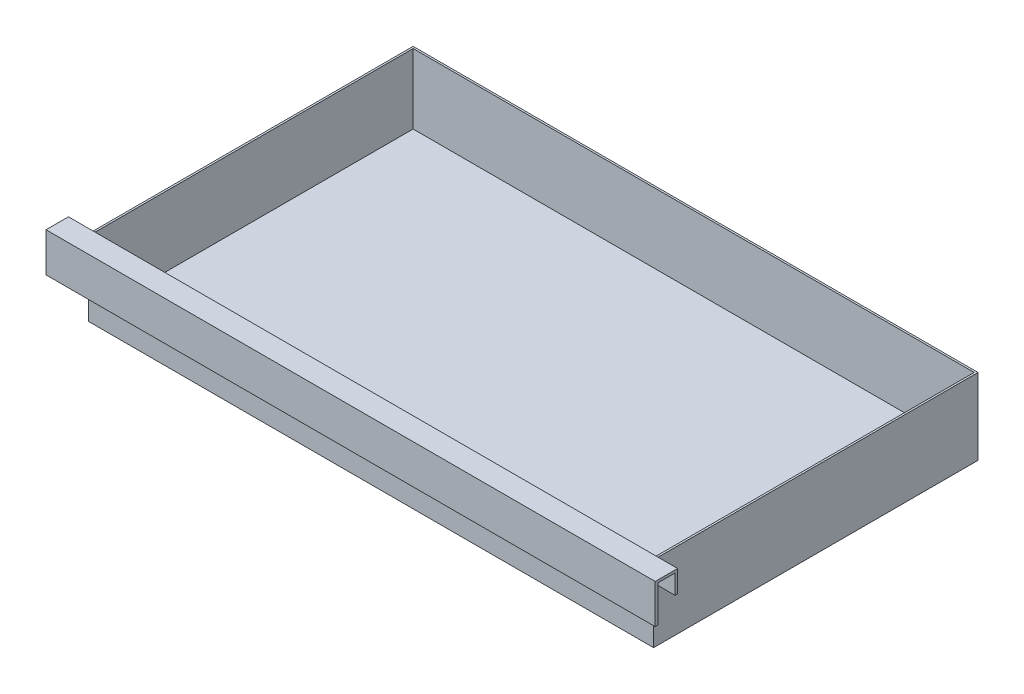
ISO-10303-21;
HEADER;
FILE_DESCRIPTION(('STEP AP214'),'2;1');
FILE_NAME('part.step','',(''),(''),'','','');
FILE_SCHEMA(('AUTOMOTIVE_DESIGN { 1 0 10303 214 1 1 1 1 }'));
ENDSEC;
DATA;
#1=APPLICATION_CONTEXT('core data for automotive mechanical design processes');
#2=APPLICATION_PROTOCOL_DEFINITION('international standard','automotive_design',2000,#1);
#3=PRODUCT_CONTEXT('',#1,'mechanical');
#4=PRODUCT('Part','Part','',(#3));
#5=PRODUCT_RELATED_PRODUCT_CATEGORY('part','',(#4));
#6=PRODUCT_DEFINITION_FORMATION('','',#4);
#7=PRODUCT_DEFINITION_CONTEXT('part definition',#1,'design');
#8=PRODUCT_DEFINITION('design','',#6,#7);
#9=PRODUCT_DEFINITION_SHAPE('','',#8);
#10=(LENGTH_UNIT() NAMED_UNIT(*) SI_UNIT(.MILLI.,.METRE.));
#11=(NAMED_UNIT(*) PLANE_ANGLE_UNIT() SI_UNIT($,.RADIAN.));
#12=(NAMED_UNIT(*) SI_UNIT($,.STERADIAN.) SOLID_ANGLE_UNIT());
#13=UNCERTAINTY_MEASURE_WITH_UNIT(LENGTH_MEASURE(1.E-05),#10,'distance_accuracy_value','');
#14=(GEOMETRIC_REPRESENTATION_CONTEXT(3) GLOBAL_UNCERTAINTY_ASSIGNED_CONTEXT((#13)) GLOBAL_UNIT_ASSIGNED_CONTEXT((#10,
#11,#12)) REPRESENTATION_CONTEXT('',''));
#15=CARTESIAN_POINT('',(0.,0.,0.));
#16=DIRECTION('',(0.,0.,1.));
#17=DIRECTION('',(1.,0.,0.));
#18=AXIS2_PLACEMENT_3D('',#15,#16,#17);
#19=CARTESIAN_POINT('',(111.8743,2.54,0.));
#20=DIRECTION('',(-1.,0.,0.));
#21=DIRECTION('',(0.,0.,1.));
#22=AXIS2_PLACEMENT_3D('',#19,#20,#21);
#23=PLANE('',#22);
#24=DIRECTION('',(0.,-1.,0.));
#25=VECTOR('',#24,1.);
#26=CARTESIAN_POINT('',(111.8743,2.54,0.));
#27=LINE('',#26,#25);
#28=CARTESIAN_POINT('',(111.8743,30.1625,0.));
#29=VERTEX_POINT('',#28);
#30=CARTESIAN_POINT('',(111.8743,22.4754146021905,0.));
#31=VERTEX_POINT('',#30);
#32=EDGE_CURVE('E57',#29,#31,#27,.T.);
#33=ORIENTED_EDGE('',*,*,#32,.T.);
#34=DIRECTION('',(0.,0.,1.));
#35=VECTOR('',#34,1.);
#36=CARTESIAN_POINT('',(111.8743,22.4754146021905,0.));
#37=LINE('',#36,#35);
#38=CARTESIAN_POINT('',(111.8743,22.4754146021905,0.7493));
#39=VERTEX_POINT('',#38);
#40=EDGE_CURVE('E176',#31,#39,#37,.T.);
#41=ORIENTED_EDGE('',*,*,#40,.T.);
#42=DIRECTION('',(0.,-1.,0.));
#43=VECTOR('',#42,1.);
#44=CARTESIAN_POINT('',(111.8743,2.54,0.7493));
#45=LINE('',#44,#43);
#46=CARTESIAN_POINT('',(111.8743,0.,0.7493));
#47=VERTEX_POINT('',#46);
#48=EDGE_CURVE('E306',#39,#47,#45,.T.);
#49=ORIENTED_EDGE('',*,*,#48,.T.);
#50=DIRECTION('',(0.,0.,-1.));
#51=VECTOR('',#50,1.);
#52=CARTESIAN_POINT('',(111.8743,0.,0.));
#53=LINE('',#52,#51);
#54=CARTESIAN_POINT('',(111.8743,0.,-127.7493));
#55=VERTEX_POINT('',#54);
#56=EDGE_CURVE('E295',#47,#55,#53,.T.);
#57=ORIENTED_EDGE('',*,*,#56,.T.);
#58=DIRECTION('',(0.,-1.,0.));
#59=VECTOR('',#58,1.);
#60=CARTESIAN_POINT('',(111.8743,2.54,-127.7493));
#61=LINE('',#60,#59);
#62=CARTESIAN_POINT('',(111.8743,30.1625,-127.7493));
#63=VERTEX_POINT('',#62);
#64=EDGE_CURVE('E11',#63,#55,#61,.T.);
#65=ORIENTED_EDGE('',*,*,#64,.F.);
#66=DIRECTION('',(0.,0.,-1.));
#67=VECTOR('',#66,1.);
#68=CARTESIAN_POINT('',(111.8743,30.1625,0.7493));
#69=LINE('',#68,#67);
#70=EDGE_CURVE('E282',#29,#63,#69,.T.);
#71=ORIENTED_EDGE('',*,*,#70,.F.);
#72=EDGE_LOOP('',(#33,#41,#49,#57,#65,#71));
#73=FACE_BOUND('',#72,.T.);
#74=ADVANCED_FACE('F43',(#73),#23,.F.);
#75=CARTESIAN_POINT('',(0.,2.54,-127.7493));
#76=DIRECTION('',(0.,0.,1.));
#77=DIRECTION('',(1.,0.,0.));
#78=AXIS2_PLACEMENT_3D('',#75,#76,#77);
#79=PLANE('',#78);
#80=DIRECTION('',(-1.,0.,0.));
#81=VECTOR('',#80,1.);
#82=CARTESIAN_POINT('',(0.,0.,-127.7493));
#83=LINE('',#82,#81);
#84=CARTESIAN_POINT('',(-111.8743,0.,-127.7493));
#85=VERTEX_POINT('',#84);
#86=EDGE_CURVE('E298',#55,#85,#83,.T.);
#87=ORIENTED_EDGE('',*,*,#86,.T.);
#88=DIRECTION('',(0.,-1.,0.));
#89=VECTOR('',#88,1.);
#90=CARTESIAN_POINT('',(-111.8743,2.54,-127.7493));
#91=LINE('',#90,#89);
#92=CARTESIAN_POINT('',(-111.8743,30.1625,-127.7493));
#93=VERTEX_POINT('',#92);
#94=EDGE_CURVE('E50',#93,#85,#91,.T.);
#95=ORIENTED_EDGE('',*,*,#94,.F.);
#96=DIRECTION('',(-1.,0.,0.));
#97=VECTOR('',#96,1.);
#98=CARTESIAN_POINT('',(111.8743,30.1625,-127.7493));
#99=LINE('',#98,#97);
#100=EDGE_CURVE('E277',#63,#93,#99,.T.);
#101=ORIENTED_EDGE('',*,*,#100,.F.);
#102=ORIENTED_EDGE('',*,*,#64,.T.);
#103=EDGE_LOOP('',(#87,#95,#101,#102));
#104=FACE_BOUND('',#103,.T.);
#105=ADVANCED_FACE('F360',(#104),#79,.F.);
#106=CARTESIAN_POINT('',(-111.8743,2.54,0.));
#107=DIRECTION('',(1.,0.,0.));
#108=DIRECTION('',(0.,0.,-1.));
#109=AXIS2_PLACEMENT_3D('',#106,#107,#108);
#110=PLANE('',#109);
#111=DIRECTION('',(0.,-1.,0.));
#112=VECTOR('',#111,1.);
#113=CARTESIAN_POINT('',(-111.8743,2.54,0.7493));
#114=LINE('',#113,#112);
#115=CARTESIAN_POINT('',(-111.8743,22.4754146021905,0.7493));
#116=VERTEX_POINT('',#115);
#117=CARTESIAN_POINT('',(-111.8743,0.,0.7493));
#118=VERTEX_POINT('',#117);
#119=EDGE_CURVE('E308',#116,#118,#114,.T.);
#120=ORIENTED_EDGE('',*,*,#119,.F.);
#121=DIRECTION('',(0.,0.,-1.));
#122=VECTOR('',#121,1.);
#123=CARTESIAN_POINT('',(-111.8743,22.4754146021905,0.));
#124=LINE('',#123,#122);
#125=CARTESIAN_POINT('',(-111.8743,22.4754146021905,0.));
#126=VERTEX_POINT('',#125);
#127=EDGE_CURVE('E65',#116,#126,#124,.T.);
#128=ORIENTED_EDGE('',*,*,#127,.T.);
#129=DIRECTION('',(0.,1.,0.));
#130=VECTOR('',#129,1.);
#131=CARTESIAN_POINT('',(-111.8743,2.54,0.));
#132=LINE('',#131,#130);
#133=CARTESIAN_POINT('',(-111.8743,30.1625,0.));
#134=VERTEX_POINT('',#133);
#135=EDGE_CURVE('E252',#126,#134,#132,.T.);
#136=ORIENTED_EDGE('',*,*,#135,.T.);
#137=DIRECTION('',(0.,0.,1.));
#138=VECTOR('',#137,1.);
#139=CARTESIAN_POINT('',(-111.8743,30.1625,-127.7493));
#140=LINE('',#139,#138);
#141=EDGE_CURVE('E280',#93,#134,#140,.T.);
#142=ORIENTED_EDGE('',*,*,#141,.F.);
#143=ORIENTED_EDGE('',*,*,#94,.T.);
#144=DIRECTION('',(0.,0.,1.));
#145=VECTOR('',#144,1.);
#146=CARTESIAN_POINT('',(-111.8743,0.,0.));
#147=LINE('',#146,#145);
#148=EDGE_CURVE('E300',#85,#118,#147,.T.);
#149=ORIENTED_EDGE('',*,*,#148,.T.);
#150=EDGE_LOOP('',(#120,#128,#136,#142,#143,#149));
#151=FACE_BOUND('',#150,.T.);
#152=ADVANCED_FACE('F312',(#151),#110,.F.);
#153=CARTESIAN_POINT('',(0.,2.54,0.7493));
#154=DIRECTION('',(0.,0.,-1.));
#155=DIRECTION('',(-1.,0.,0.));
#156=AXIS2_PLACEMENT_3D('',#153,#154,#155);
#157=PLANE('',#156);
#158=ORIENTED_EDGE('',*,*,#48,.F.);
#159=DIRECTION('',(-1.,0.,0.));
#160=VECTOR('',#159,1.);
#161=CARTESIAN_POINT('',(0.,22.4754146021905,0.7493));
#162=LINE('',#161,#160);
#163=EDGE_CURVE('E255',#39,#116,#162,.T.);
#164=ORIENTED_EDGE('',*,*,#163,.T.);
#165=ORIENTED_EDGE('',*,*,#119,.T.);
#166=DIRECTION('',(1.,0.,0.));
#167=VECTOR('',#166,1.);
#168=CARTESIAN_POINT('',(0.,0.,0.7493));
#169=LINE('',#168,#167);
#170=EDGE_CURVE('E303',#118,#47,#169,.T.);
#171=ORIENTED_EDGE('',*,*,#170,.T.);
#172=EDGE_LOOP('',(#158,#164,#165,#171));
#173=FACE_BOUND('',#172,.T.);
#174=ADVANCED_FACE('F321',(#173),#157,.F.);
#175=CARTESIAN_POINT('',(0.,0.,0.));
#176=DIRECTION('',(0.,1.,0.));
#177=DIRECTION('',(0.,0.,1.));
#178=AXIS2_PLACEMENT_3D('',#175,#176,#177);
#179=PLANE('',#178);
#180=ORIENTED_EDGE('',*,*,#56,.F.);
#181=ORIENTED_EDGE('',*,*,#170,.F.);
#182=ORIENTED_EDGE('',*,*,#148,.F.);
#183=ORIENTED_EDGE('',*,*,#86,.F.);
#184=EDGE_LOOP('',(#180,#181,#182,#183));
#185=FACE_BOUND('',#184,.T.);
#186=ADVANCED_FACE('F318',(#185),#179,.F.);
#187=CARTESIAN_POINT('',(0.,30.1625,0.));
#188=DIRECTION('',(0.,1.,0.));
#189=DIRECTION('',(0.,0.,1.));
#190=AXIS2_PLACEMENT_3D('',#187,#188,#189);
#191=PLANE('',#190);
#192=DIRECTION('',(-1.,0.,0.));
#193=VECTOR('',#192,1.);
#194=CARTESIAN_POINT('',(0.,30.1625,0.));
#195=LINE('',#194,#193);
#196=CARTESIAN_POINT('',(111.125,30.1625,0.));
#197=VERTEX_POINT('',#196);
#198=EDGE_CURVE('E249',#29,#197,#195,.T.);
#199=ORIENTED_EDGE('',*,*,#198,.F.);
#200=ORIENTED_EDGE('',*,*,#70,.T.);
#201=ORIENTED_EDGE('',*,*,#100,.T.);
#202=ORIENTED_EDGE('',*,*,#141,.T.);
#203=CARTESIAN_POINT('',(-111.125,30.1625,0.));
#204=VERTEX_POINT('',#203);
#205=EDGE_CURVE('E236',#204,#134,#195,.T.);
#206=ORIENTED_EDGE('',*,*,#205,.F.);
#207=DIRECTION('',(0.,0.,1.));
#208=VECTOR('',#207,1.);
#209=CARTESIAN_POINT('',(-111.125,30.1625,-127.));
#210=LINE('',#209,#208);
#211=CARTESIAN_POINT('',(-111.125,30.1625,-127.));
#212=VERTEX_POINT('',#211);
#213=EDGE_CURVE('E259',#212,#204,#210,.T.);
#214=ORIENTED_EDGE('',*,*,#213,.F.);
#215=DIRECTION('',(-1.,0.,0.));
#216=VECTOR('',#215,1.);
#217=CARTESIAN_POINT('',(111.125,30.1625,-127.));
#218=LINE('',#217,#216);
#219=CARTESIAN_POINT('',(111.125,30.1625,-127.));
#220=VERTEX_POINT('',#219);
#221=EDGE_CURVE('E265',#220,#212,#218,.T.);
#222=ORIENTED_EDGE('',*,*,#221,.F.);
#223=DIRECTION('',(0.,0.,-1.));
#224=VECTOR('',#223,1.);
#225=CARTESIAN_POINT('',(111.125,30.1625,0.));
#226=LINE('',#225,#224);
#227=EDGE_CURVE('E262',#197,#220,#226,.T.);
#228=ORIENTED_EDGE('',*,*,#227,.F.);
#229=EDGE_LOOP('',(#199,#200,#201,#202,#206,#214,#222,#228));
#230=FACE_BOUND('',#229,.T.);
#231=ADVANCED_FACE('F374',(#230),#191,.T.);
#232=CARTESIAN_POINT('',(-111.125,30.1625,-127.));
#233=DIRECTION('',(1.,0.,0.));
#234=DIRECTION('',(0.,0.,-1.));
#235=AXIS2_PLACEMENT_3D('',#232,#233,#234);
#236=PLANE('',#235);
#237=DIRECTION('',(0.,-1.,0.));
#238=VECTOR('',#237,1.);
#239=CARTESIAN_POINT('',(-111.125,30.1625,0.));
#240=LINE('',#239,#238);
#241=CARTESIAN_POINT('',(-111.125,2.54,0.));
#242=VERTEX_POINT('',#241);
#243=EDGE_CURVE('E275',#204,#242,#240,.T.);
#244=ORIENTED_EDGE('',*,*,#243,.T.);
#245=DIRECTION('',(0.,0.,-1.));
#246=VECTOR('',#245,1.);
#247=CARTESIAN_POINT('',(-111.125,2.54,0.));
#248=LINE('',#247,#246);
#249=CARTESIAN_POINT('',(-111.125,2.54,-127.));
#250=VERTEX_POINT('',#249);
#251=EDGE_CURVE('E292',#242,#250,#248,.T.);
#252=ORIENTED_EDGE('',*,*,#251,.T.);
#253=DIRECTION('',(0.,-1.,0.));
#254=VECTOR('',#253,1.);
#255=CARTESIAN_POINT('',(-111.125,30.1625,-127.));
#256=LINE('',#255,#254);
#257=EDGE_CURVE('E267',#212,#250,#256,.T.);
#258=ORIENTED_EDGE('',*,*,#257,.F.);
#259=ORIENTED_EDGE('',*,*,#213,.T.);
#260=EDGE_LOOP('',(#244,#252,#258,#259));
#261=FACE_BOUND('',#260,.T.);
#262=ADVANCED_FACE('F380',(#261),#236,.T.);
#263=CARTESIAN_POINT('',(-111.125,30.1625,0.));
#264=DIRECTION('',(0.,0.,-1.));
#265=DIRECTION('',(-1.,0.,0.));
#266=AXIS2_PLACEMENT_3D('',#263,#264,#265);
#267=PLANE('',#266);
#268=DIRECTION('',(-1.,0.,0.));
#269=VECTOR('',#268,1.);
#270=CARTESIAN_POINT('',(0.,2.54,0.));
#271=LINE('',#270,#269);
#272=CARTESIAN_POINT('',(111.125,2.54,0.));
#273=VERTEX_POINT('',#272);
#274=EDGE_CURVE('E290',#273,#242,#271,.T.);
#275=ORIENTED_EDGE('',*,*,#274,.T.);
#276=ORIENTED_EDGE('',*,*,#243,.F.);
#277=ORIENTED_EDGE('',*,*,#205,.T.);
#278=ORIENTED_EDGE('',*,*,#135,.F.);
#279=DIRECTION('',(1.,0.,0.));
#280=VECTOR('',#279,1.);
#281=CARTESIAN_POINT('',(-120.65,22.4754146021905,0.));
#282=LINE('',#281,#280);
#283=CARTESIAN_POINT('',(-120.65,22.4754146021905,0.));
#284=VERTEX_POINT('',#283);
#285=EDGE_CURVE('E178',#284,#126,#282,.T.);
#286=ORIENTED_EDGE('',*,*,#285,.F.);
#287=DIRECTION('',(0.,1.,0.));
#288=VECTOR('',#287,1.);
#289=CARTESIAN_POINT('',(-120.65,22.4754146021905,0.));
#290=LINE('',#289,#288);
#291=CARTESIAN_POINT('',(-120.65,31.1785,0.));
#292=VERTEX_POINT('',#291);
#293=EDGE_CURVE('E215',#284,#292,#290,.T.);
#294=ORIENTED_EDGE('',*,*,#293,.T.);
#295=DIRECTION('',(1.,0.,0.));
#296=VECTOR('',#295,1.);
#297=CARTESIAN_POINT('',(-120.65,31.1785,0.));
#298=LINE('',#297,#296);
#299=CARTESIAN_POINT('',(120.65,31.1785,0.));
#300=VERTEX_POINT('',#299);
#301=EDGE_CURVE('E186',#292,#300,#298,.T.);
#302=ORIENTED_EDGE('',*,*,#301,.T.);
#303=DIRECTION('',(0.,1.,0.));
#304=VECTOR('',#303,1.);
#305=CARTESIAN_POINT('',(120.65,22.4754146021905,0.));
#306=LINE('',#305,#304);
#307=CARTESIAN_POINT('',(120.65,22.4754146021905,0.));
#308=VERTEX_POINT('',#307);
#309=EDGE_CURVE('E182',#308,#300,#306,.T.);
#310=ORIENTED_EDGE('',*,*,#309,.F.);
#311=EDGE_CURVE('E170',#31,#308,#282,.T.);
#312=ORIENTED_EDGE('',*,*,#311,.F.);
#313=ORIENTED_EDGE('',*,*,#32,.F.);
#314=ORIENTED_EDGE('',*,*,#198,.T.);
#315=DIRECTION('',(0.,-1.,0.));
#316=VECTOR('',#315,1.);
#317=CARTESIAN_POINT('',(111.125,30.1625,0.));
#318=LINE('',#317,#316);
#319=EDGE_CURVE('E273',#197,#273,#318,.T.);
#320=ORIENTED_EDGE('',*,*,#319,.T.);
#321=EDGE_LOOP('',(#275,#276,#277,#278,#286,#294,#302,#310,#312,#313,#314,#320));
#322=FACE_BOUND('',#321,.T.);
#323=ADVANCED_FACE('F184',(#322),#267,.T.);
#324=CARTESIAN_POINT('',(111.125,30.1625,0.));
#325=DIRECTION('',(-1.,0.,0.));
#326=DIRECTION('',(0.,0.,1.));
#327=AXIS2_PLACEMENT_3D('',#324,#325,#326);
#328=PLANE('',#327);
#329=DIRECTION('',(0.,-1.,0.));
#330=VECTOR('',#329,1.);
#331=CARTESIAN_POINT('',(111.125,30.1625,-127.));
#332=LINE('',#331,#330);
#333=CARTESIAN_POINT('',(111.125,2.54000000000001,-127.));
#334=VERTEX_POINT('',#333);
#335=EDGE_CURVE('E270',#220,#334,#332,.T.);
#336=ORIENTED_EDGE('',*,*,#335,.T.);
#337=DIRECTION('',(0.,0.,1.));
#338=VECTOR('',#337,1.);
#339=CARTESIAN_POINT('',(111.125,2.54,0.));
#340=LINE('',#339,#338);
#341=EDGE_CURVE('E287',#334,#273,#340,.T.);
#342=ORIENTED_EDGE('',*,*,#341,.T.);
#343=ORIENTED_EDGE('',*,*,#319,.F.);
#344=ORIENTED_EDGE('',*,*,#227,.T.);
#345=EDGE_LOOP('',(#336,#342,#343,#344));
#346=FACE_BOUND('',#345,.T.);
#347=ADVANCED_FACE('F387',(#346),#328,.T.);
#348=CARTESIAN_POINT('',(111.125,30.1625,-127.));
#349=DIRECTION('',(0.,0.,1.));
#350=DIRECTION('',(1.,0.,0.));
#351=AXIS2_PLACEMENT_3D('',#348,#349,#350);
#352=PLANE('',#351);
#353=ORIENTED_EDGE('',*,*,#257,.T.);
#354=DIRECTION('',(1.,0.,0.));
#355=VECTOR('',#354,1.);
#356=CARTESIAN_POINT('',(0.,2.54,-127.));
#357=LINE('',#356,#355);
#358=EDGE_CURVE('E284',#250,#334,#357,.T.);
#359=ORIENTED_EDGE('',*,*,#358,.T.);
#360=ORIENTED_EDGE('',*,*,#335,.F.);
#361=ORIENTED_EDGE('',*,*,#221,.T.);
#362=EDGE_LOOP('',(#353,#359,#360,#361));
#363=FACE_BOUND('',#362,.T.);
#364=ADVANCED_FACE('F376',(#363),#352,.T.);
#365=CARTESIAN_POINT('',(0.,2.54,0.));
#366=DIRECTION('',(0.,1.,0.));
#367=DIRECTION('',(0.,0.,1.));
#368=AXIS2_PLACEMENT_3D('',#365,#366,#367);
#369=PLANE('',#368);
#370=ORIENTED_EDGE('',*,*,#251,.F.);
#371=ORIENTED_EDGE('',*,*,#274,.F.);
#372=ORIENTED_EDGE('',*,*,#341,.F.);
#373=ORIENTED_EDGE('',*,*,#358,.F.);
#374=EDGE_LOOP('',(#370,#371,#372,#373));
#375=FACE_BOUND('',#374,.T.);
#376=ADVANCED_FACE('F356',(#375),#369,.T.);
#377=CARTESIAN_POINT('',(-120.65,22.4754146021905,1.016));
#378=DIRECTION('',(0.,-1.,0.));
#379=DIRECTION('',(0.,0.,-1.));
#380=AXIS2_PLACEMENT_3D('',#377,#378,#379);
#381=PLANE('',#380);
#382=ORIENTED_EDGE('',*,*,#40,.F.);
#383=ORIENTED_EDGE('',*,*,#311,.T.);
#384=DIRECTION('',(0.,0.,-1.));
#385=VECTOR('',#384,1.);
#386=CARTESIAN_POINT('',(120.65,22.4754146021905,1.016));
#387=LINE('',#386,#385);
#388=CARTESIAN_POINT('',(120.65,22.4754146021905,1.016));
#389=VERTEX_POINT('',#388);
#390=EDGE_CURVE('E174',#389,#308,#387,.T.);
#391=ORIENTED_EDGE('',*,*,#390,.F.);
#392=DIRECTION('',(1.,0.,0.));
#393=VECTOR('',#392,1.);
#394=CARTESIAN_POINT('',(-120.65,22.4754146021905,1.016));
#395=LINE('',#394,#393);
#396=CARTESIAN_POINT('',(-120.65,22.4754146021905,1.016));
#397=VERTEX_POINT('',#396);
#398=EDGE_CURVE('E234',#397,#389,#395,.T.);
#399=ORIENTED_EDGE('',*,*,#398,.F.);
#400=DIRECTION('',(0.,0.,-1.));
#401=VECTOR('',#400,1.);
#402=CARTESIAN_POINT('',(-120.65,22.4754146021905,1.016));
#403=LINE('',#402,#401);
#404=EDGE_CURVE('E212',#397,#284,#403,.T.);
#405=ORIENTED_EDGE('',*,*,#404,.T.);
#406=ORIENTED_EDGE('',*,*,#285,.T.);
#407=ORIENTED_EDGE('',*,*,#127,.F.);
#408=ORIENTED_EDGE('',*,*,#163,.F.);
#409=EDGE_LOOP('',(#382,#383,#391,#399,#405,#406,#407,#408));
#410=FACE_BOUND('',#409,.T.);
#411=ADVANCED_FACE('F172',(#410),#381,.T.);
#412=CARTESIAN_POINT('',(-120.65,22.4754146021905,1.016));
#413=DIRECTION('',(0.,0.,1.));
#414=DIRECTION('',(1.,0.,0.));
#415=AXIS2_PLACEMENT_3D('',#412,#413,#414);
#416=PLANE('',#415);
#417=ORIENTED_EDGE('',*,*,#398,.T.);
#418=DIRECTION('',(0.,-1.,0.));
#419=VECTOR('',#418,1.);
#420=CARTESIAN_POINT('',(120.65,22.4754146021905,1.016));
#421=LINE('',#420,#419);
#422=CARTESIAN_POINT('',(120.65,30.1625,1.016));
#423=VERTEX_POINT('',#422);
#424=EDGE_CURVE('E196',#423,#389,#421,.T.);
#425=ORIENTED_EDGE('',*,*,#424,.F.);
#426=DIRECTION('',(1.,0.,0.));
#427=VECTOR('',#426,1.);
#428=CARTESIAN_POINT('',(-120.65,30.1625,1.016));
#429=LINE('',#428,#427);
#430=CARTESIAN_POINT('',(-120.65,30.1625,1.016));
#431=VERTEX_POINT('',#430);
#432=EDGE_CURVE('E237',#431,#423,#429,.T.);
#433=ORIENTED_EDGE('',*,*,#432,.F.);
#434=DIRECTION('',(0.,-1.,0.));
#435=VECTOR('',#434,1.);
#436=CARTESIAN_POINT('',(-120.65,22.4754146021905,1.016));
#437=LINE('',#436,#435);
#438=EDGE_CURVE('E179',#431,#397,#437,.T.);
#439=ORIENTED_EDGE('',*,*,#438,.T.);
#440=EDGE_LOOP('',(#417,#425,#433,#439));
#441=FACE_BOUND('',#440,.T.);
#442=ADVANCED_FACE('F348',(#441),#416,.T.);
#443=CARTESIAN_POINT('',(-120.65,30.1625,1.016));
#444=DIRECTION('',(0.,-1.,0.));
#445=DIRECTION('',(0.,0.,-1.));
#446=AXIS2_PLACEMENT_3D('',#443,#444,#445);
#447=PLANE('',#446);
#448=ORIENTED_EDGE('',*,*,#432,.T.);
#449=DIRECTION('',(0.,0.,-1.));
#450=VECTOR('',#449,1.);
#451=CARTESIAN_POINT('',(120.65,30.1625,1.016));
#452=LINE('',#451,#450);
#453=CARTESIAN_POINT('',(120.65,30.1625,7.874));
#454=VERTEX_POINT('',#453);
#455=EDGE_CURVE('E209',#454,#423,#452,.T.);
#456=ORIENTED_EDGE('',*,*,#455,.F.);
#457=DIRECTION('',(1.,0.,0.));
#458=VECTOR('',#457,1.);
#459=CARTESIAN_POINT('',(-120.65,30.1625,7.874));
#460=LINE('',#459,#458);
#461=CARTESIAN_POINT('',(-120.65,30.1625,7.874));
#462=VERTEX_POINT('',#461);
#463=EDGE_CURVE('E239',#462,#454,#460,.T.);
#464=ORIENTED_EDGE('',*,*,#463,.F.);
#465=DIRECTION('',(0.,0.,-1.));
#466=VECTOR('',#465,1.);
#467=CARTESIAN_POINT('',(-120.65,30.1625,1.016));
#468=LINE('',#467,#466);
#469=EDGE_CURVE('E229',#462,#431,#468,.T.);
#470=ORIENTED_EDGE('',*,*,#469,.T.);
#471=EDGE_LOOP('',(#448,#456,#464,#470));
#472=FACE_BOUND('',#471,.T.);
#473=ADVANCED_FACE('F346',(#472),#447,.T.);
#474=CARTESIAN_POINT('',(-120.65,30.1625,7.874));
#475=DIRECTION('',(0.,0.,-1.));
#476=DIRECTION('',(0.,1.,0.));
#477=AXIS2_PLACEMENT_3D('',#474,#475,#476);
#478=PLANE('',#477);
#479=ORIENTED_EDGE('',*,*,#463,.T.);
#480=DIRECTION('',(0.,1.,0.));
#481=VECTOR('',#480,1.);
#482=CARTESIAN_POINT('',(120.65,30.1625,7.874));
#483=LINE('',#482,#481);
#484=CARTESIAN_POINT('',(120.65,15.6845,7.874));
#485=VERTEX_POINT('',#484);
#486=EDGE_CURVE('E206',#485,#454,#483,.T.);
#487=ORIENTED_EDGE('',*,*,#486,.F.);
#488=DIRECTION('',(1.,0.,0.));
#489=VECTOR('',#488,1.);
#490=CARTESIAN_POINT('',(-120.65,15.6845,7.874));
#491=LINE('',#490,#489);
#492=CARTESIAN_POINT('',(-120.65,15.6845,7.874));
#493=VERTEX_POINT('',#492);
#494=EDGE_CURVE('E241',#493,#485,#491,.T.);
#495=ORIENTED_EDGE('',*,*,#494,.F.);
#496=DIRECTION('',(0.,1.,0.));
#497=VECTOR('',#496,1.);
#498=CARTESIAN_POINT('',(-120.65,30.1625,7.874));
#499=LINE('',#498,#497);
#500=EDGE_CURVE('E226',#493,#462,#499,.T.);
#501=ORIENTED_EDGE('',*,*,#500,.T.);
#502=EDGE_LOOP('',(#479,#487,#495,#501));
#503=FACE_BOUND('',#502,.T.);
#504=ADVANCED_FACE('F342',(#503),#478,.T.);
#505=CARTESIAN_POINT('',(-120.65,15.6845,8.89));
#506=DIRECTION('',(0.,-1.,0.));
#507=DIRECTION('',(0.,0.,-1.));
#508=AXIS2_PLACEMENT_3D('',#505,#506,#507);
#509=PLANE('',#508);
#510=ORIENTED_EDGE('',*,*,#494,.T.);
#511=DIRECTION('',(0.,0.,-1.));
#512=VECTOR('',#511,1.);
#513=CARTESIAN_POINT('',(120.65,15.6845,8.89));
#514=LINE('',#513,#512);
#515=CARTESIAN_POINT('',(120.65,15.6845,8.89));
#516=VERTEX_POINT('',#515);
#517=EDGE_CURVE('E203',#516,#485,#514,.T.);
#518=ORIENTED_EDGE('',*,*,#517,.F.);
#519=DIRECTION('',(1.,0.,0.));
#520=VECTOR('',#519,1.);
#521=CARTESIAN_POINT('',(-120.65,15.6845,8.89));
#522=LINE('',#521,#520);
#523=CARTESIAN_POINT('',(-120.65,15.6845,8.89));
#524=VERTEX_POINT('',#523);
#525=EDGE_CURVE('E243',#524,#516,#522,.T.);
#526=ORIENTED_EDGE('',*,*,#525,.F.);
#527=DIRECTION('',(0.,0.,-1.));
#528=VECTOR('',#527,1.);
#529=CARTESIAN_POINT('',(-120.65,15.6845,8.89));
#530=LINE('',#529,#528);
#531=EDGE_CURVE('E223',#524,#493,#530,.T.);
#532=ORIENTED_EDGE('',*,*,#531,.T.);
#533=EDGE_LOOP('',(#510,#518,#526,#532));
#534=FACE_BOUND('',#533,.T.);
#535=ADVANCED_FACE('F338',(#534),#509,.T.);
#536=CARTESIAN_POINT('',(-120.65,31.1785,8.89));
#537=DIRECTION('',(0.,0.,1.));
#538=DIRECTION('',(0.,-1.,0.));
#539=AXIS2_PLACEMENT_3D('',#536,#537,#538);
#540=PLANE('',#539);
#541=ORIENTED_EDGE('',*,*,#525,.T.);
#542=DIRECTION('',(0.,-1.,0.));
#543=VECTOR('',#542,1.);
#544=CARTESIAN_POINT('',(120.65,31.1785,8.89));
#545=LINE('',#544,#543);
#546=CARTESIAN_POINT('',(120.65,31.1785,8.89));
#547=VERTEX_POINT('',#546);
#548=EDGE_CURVE('E200',#547,#516,#545,.T.);
#549=ORIENTED_EDGE('',*,*,#548,.F.);
#550=DIRECTION('',(1.,0.,0.));
#551=VECTOR('',#550,1.);
#552=CARTESIAN_POINT('',(-120.65,31.1785,8.89));
#553=LINE('',#552,#551);
#554=CARTESIAN_POINT('',(-120.65,31.1785,8.89));
#555=VERTEX_POINT('',#554);
#556=EDGE_CURVE('E245',#555,#547,#553,.T.);
#557=ORIENTED_EDGE('',*,*,#556,.F.);
#558=DIRECTION('',(0.,-1.,0.));
#559=VECTOR('',#558,1.);
#560=CARTESIAN_POINT('',(-120.65,31.1785,8.89));
#561=LINE('',#560,#559);
#562=EDGE_CURVE('E220',#555,#524,#561,.T.);
#563=ORIENTED_EDGE('',*,*,#562,.T.);
#564=EDGE_LOOP('',(#541,#549,#557,#563));
#565=FACE_BOUND('',#564,.T.);
#566=ADVANCED_FACE('F336',(#565),#540,.T.);
#567=CARTESIAN_POINT('',(-120.65,31.1785,0.));
#568=DIRECTION('',(0.,1.,0.));
#569=DIRECTION('',(0.,0.,1.));
#570=AXIS2_PLACEMENT_3D('',#567,#568,#569);
#571=PLANE('',#570);
#572=ORIENTED_EDGE('',*,*,#556,.T.);
#573=DIRECTION('',(0.,0.,1.));
#574=VECTOR('',#573,1.);
#575=CARTESIAN_POINT('',(120.65,31.1785,0.));
#576=LINE('',#575,#574);
#577=EDGE_CURVE('E190',#300,#547,#576,.T.);
#578=ORIENTED_EDGE('',*,*,#577,.F.);
#579=ORIENTED_EDGE('',*,*,#301,.F.);
#580=DIRECTION('',(0.,0.,1.));
#581=VECTOR('',#580,1.);
#582=CARTESIAN_POINT('',(-120.65,31.1785,0.));
#583=LINE('',#582,#581);
#584=EDGE_CURVE('E217',#292,#555,#583,.T.);
#585=ORIENTED_EDGE('',*,*,#584,.T.);
#586=EDGE_LOOP('',(#572,#578,#579,#585));
#587=FACE_BOUND('',#586,.T.);
#588=ADVANCED_FACE('F332',(#587),#571,.T.);
#589=CARTESIAN_POINT('',(-120.65,0.,0.));
#590=DIRECTION('',(1.,0.,0.));
#591=DIRECTION('',(0.,0.,-1.));
#592=AXIS2_PLACEMENT_3D('',#589,#590,#591);
#593=PLANE('',#592);
#594=ORIENTED_EDGE('',*,*,#404,.F.);
#595=ORIENTED_EDGE('',*,*,#438,.F.);
#596=ORIENTED_EDGE('',*,*,#469,.F.);
#597=ORIENTED_EDGE('',*,*,#500,.F.);
#598=ORIENTED_EDGE('',*,*,#531,.F.);
#599=ORIENTED_EDGE('',*,*,#562,.F.);
#600=ORIENTED_EDGE('',*,*,#584,.F.);
#601=ORIENTED_EDGE('',*,*,#293,.F.);
#602=EDGE_LOOP('',(#594,#595,#596,#597,#598,#599,#600,#601));
#603=FACE_BOUND('',#602,.T.);
#604=ADVANCED_FACE('F327',(#603),#593,.F.);
#605=CARTESIAN_POINT('',(120.65,0.,0.));
#606=DIRECTION('',(1.,0.,0.));
#607=DIRECTION('',(0.,0.,-1.));
#608=AXIS2_PLACEMENT_3D('',#605,#606,#607);
#609=PLANE('',#608);
#610=ORIENTED_EDGE('',*,*,#390,.T.);
#611=ORIENTED_EDGE('',*,*,#309,.T.);
#612=ORIENTED_EDGE('',*,*,#577,.T.);
#613=ORIENTED_EDGE('',*,*,#548,.T.);
#614=ORIENTED_EDGE('',*,*,#517,.T.);
#615=ORIENTED_EDGE('',*,*,#486,.T.);
#616=ORIENTED_EDGE('',*,*,#455,.T.);
#617=ORIENTED_EDGE('',*,*,#424,.T.);
#618=EDGE_LOOP('',(#610,#611,#612,#613,#614,#615,#616,#617));
#619=FACE_BOUND('',#618,.T.);
#620=ADVANCED_FACE('F193',(#619),#609,.T.);
#621=CLOSED_SHELL('',(#74,#105,#152,#174,#186,#231,#262,#323,#347,#364,#376,#411,#442,#473,#504,
#535,#566,#588,#604,#620));
#622=MANIFOLD_SOLID_BREP('B2',#621);
#623=ADVANCED_BREP_SHAPE_REPRESENTATION('',(#18,#622),#14);
#624=SHAPE_DEFINITION_REPRESENTATION(#9,#623);
ENDSEC;
END-ISO-10303-21;
